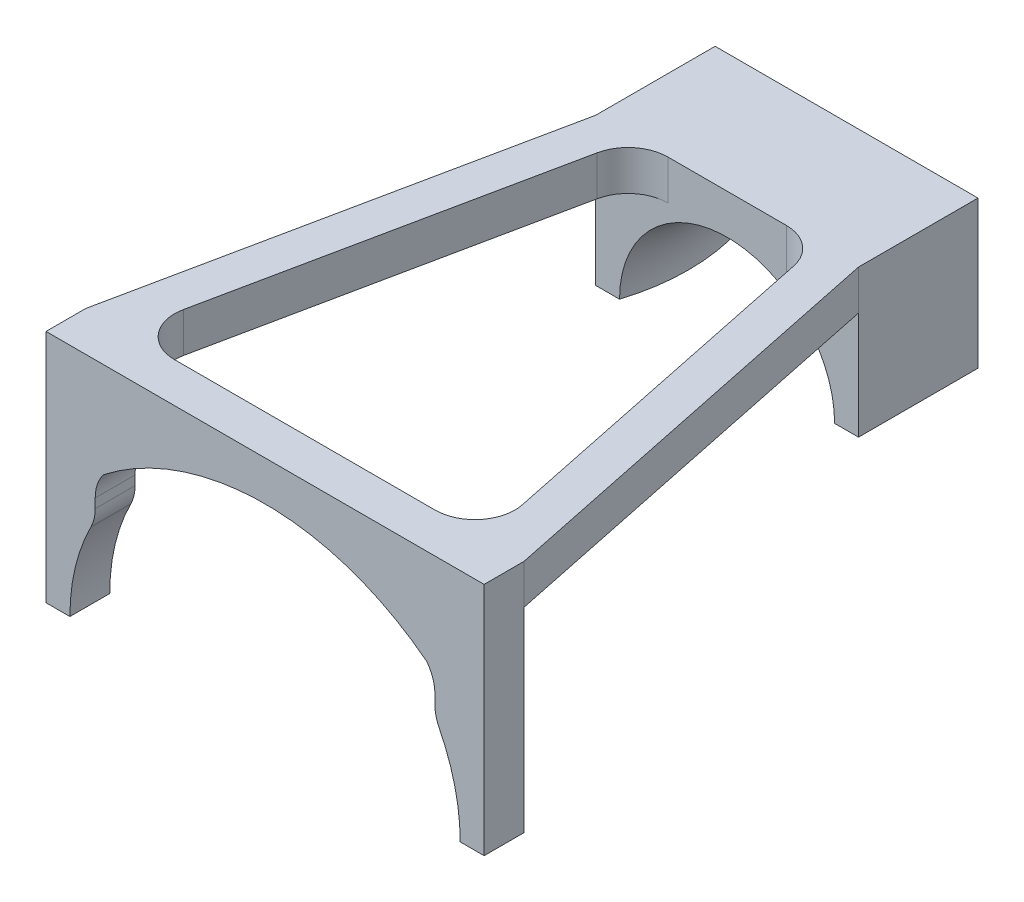
ISO-10303-21;
HEADER;
FILE_DESCRIPTION(('STEP AP214'),'2;1');
FILE_NAME('part.step','',(''),(''),'','','');
FILE_SCHEMA(('AUTOMOTIVE_DESIGN { 1 0 10303 214 1 1 1 1 }'));
ENDSEC;
DATA;
#1=APPLICATION_CONTEXT('core data for automotive mechanical design processes');
#2=APPLICATION_PROTOCOL_DEFINITION('international standard','automotive_design',2000,#1);
#3=PRODUCT_CONTEXT('',#1,'mechanical');
#4=PRODUCT('Part','Part','',(#3));
#5=PRODUCT_RELATED_PRODUCT_CATEGORY('part','',(#4));
#6=PRODUCT_DEFINITION_FORMATION('','',#4);
#7=PRODUCT_DEFINITION_CONTEXT('part definition',#1,'design');
#8=PRODUCT_DEFINITION('design','',#6,#7);
#9=PRODUCT_DEFINITION_SHAPE('','',#8);
#10=(LENGTH_UNIT() NAMED_UNIT(*) SI_UNIT(.MILLI.,.METRE.));
#11=(NAMED_UNIT(*) PLANE_ANGLE_UNIT() SI_UNIT($,.RADIAN.));
#12=(NAMED_UNIT(*) SI_UNIT($,.STERADIAN.) SOLID_ANGLE_UNIT());
#13=UNCERTAINTY_MEASURE_WITH_UNIT(LENGTH_MEASURE(1.E-05),#10,'distance_accuracy_value','');
#14=(GEOMETRIC_REPRESENTATION_CONTEXT(3) GLOBAL_UNCERTAINTY_ASSIGNED_CONTEXT((#13)) GLOBAL_UNIT_ASSIGNED_CONTEXT((#10,
#11,#12)) REPRESENTATION_CONTEXT('',''));
#15=CARTESIAN_POINT('',(0.,0.,0.));
#16=DIRECTION('',(0.,0.,1.));
#17=DIRECTION('',(1.,0.,0.));
#18=AXIS2_PLACEMENT_3D('',#15,#16,#17);
#19=CARTESIAN_POINT('',(0.,0.,0.));
#20=DIRECTION('',(0.,0.,-1.));
#21=DIRECTION('',(-1.,0.,0.));
#22=AXIS2_PLACEMENT_3D('',#19,#20,#21);
#23=PLANE('',#22);
#24=DIRECTION('',(1.,0.,0.));
#25=VECTOR('',#24,1.);
#26=CARTESIAN_POINT('',(-27.5,24.5,0.));
#27=LINE('',#26,#25);
#28=CARTESIAN_POINT('',(-27.5,24.5,0.));
#29=VERTEX_POINT('',#28);
#30=CARTESIAN_POINT('',(-16.3557099612361,24.5,0.));
#31=VERTEX_POINT('',#30);
#32=EDGE_CURVE('E55',#29,#31,#27,.T.);
#33=ORIENTED_EDGE('',*,*,#32,.T.);
#34=DIRECTION('',(0.,1.,0.));
#35=VECTOR('',#34,1.);
#36=CARTESIAN_POINT('',(-16.3557099612361,29.5,0.));
#37=LINE('',#36,#35);
#38=CARTESIAN_POINT('',(-16.3557099612361,29.5,0.));
#39=VERTEX_POINT('',#38);
#40=EDGE_CURVE('E364',#31,#39,#37,.T.);
#41=ORIENTED_EDGE('',*,*,#40,.T.);
#42=DIRECTION('',(-1.,0.,0.));
#43=VECTOR('',#42,1.);
#44=CARTESIAN_POINT('',(-27.5,29.5,0.));
#45=LINE('',#44,#43);
#46=CARTESIAN_POINT('',(16.3557099612361,29.5,0.));
#47=VERTEX_POINT('',#46);
#48=EDGE_CURVE('E391',#47,#39,#45,.T.);
#49=ORIENTED_EDGE('',*,*,#48,.F.);
#50=DIRECTION('',(0.,1.,0.));
#51=VECTOR('',#50,1.);
#52=CARTESIAN_POINT('',(16.3557099612361,24.5,0.));
#53=LINE('',#52,#51);
#54=CARTESIAN_POINT('',(16.3557099612361,24.5,0.));
#55=VERTEX_POINT('',#54);
#56=EDGE_CURVE('E263',#47,#55,#53,.F.);
#57=ORIENTED_EDGE('',*,*,#56,.T.);
#58=DIRECTION('',(1.,0.,0.));
#59=VECTOR('',#58,1.);
#60=CARTESIAN_POINT('',(27.5,24.5,0.));
#61=LINE('',#60,#59);
#62=CARTESIAN_POINT('',(27.5,24.5,0.));
#63=VERTEX_POINT('',#62);
#64=EDGE_CURVE('E62',#55,#63,#61,.T.);
#65=ORIENTED_EDGE('',*,*,#64,.T.);
#66=DIRECTION('',(0.,1.,0.));
#67=VECTOR('',#66,1.);
#68=CARTESIAN_POINT('',(27.5,0.,0.));
#69=LINE('',#68,#67);
#70=CARTESIAN_POINT('',(27.5,0.,0.));
#71=VERTEX_POINT('',#70);
#72=EDGE_CURVE('E260',#71,#63,#69,.T.);
#73=ORIENTED_EDGE('',*,*,#72,.F.);
#74=DIRECTION('',(1.,0.,0.));
#75=VECTOR('',#74,1.);
#76=CARTESIAN_POINT('',(24.5,0.,0.));
#77=LINE('',#76,#75);
#78=CARTESIAN_POINT('',(24.5,0.,0.));
#79=VERTEX_POINT('',#78);
#80=EDGE_CURVE('E275',#79,#71,#77,.T.);
#81=ORIENTED_EDGE('',*,*,#80,.F.);
#82=CARTESIAN_POINT('',(0.,0.,0.));
#83=DIRECTION('',(0.,0.,-1.));
#84=DIRECTION('',(-1.,0.,0.));
#85=AXIS2_PLACEMENT_3D('',#82,#83,#84);
#86=CIRCLE('',#85,24.5);
#87=CARTESIAN_POINT('',(21.8615384615385,11.0599790277683,0.));
#88=VERTEX_POINT('',#87);
#89=EDGE_CURVE('E282',#88,#79,#86,.T.);
#90=ORIENTED_EDGE('',*,*,#89,.F.);
#91=CARTESIAN_POINT('',(26.3230769230769,13.3171176048639,0.));
#92=DIRECTION('',(0.,0.,1.));
#93=DIRECTION('',(1.,0.,0.));
#94=AXIS2_PLACEMENT_3D('',#91,#92,#93);
#95=CIRCLE('',#94,5.);
#96=CARTESIAN_POINT('',(21.3230769230769,13.3171176048639,0.));
#97=VERTEX_POINT('',#96);
#98=EDGE_CURVE('E575',#97,#88,#95,.T.);
#99=ORIENTED_EDGE('',*,*,#98,.F.);
#100=DIRECTION('',(0.,-1.,0.));
#101=VECTOR('',#100,1.);
#102=CARTESIAN_POINT('',(21.3230769230769,14.4852505589068,0.));
#103=LINE('',#102,#101);
#104=CARTESIAN_POINT('',(21.3230769230769,14.4852505589068,0.));
#105=VERTEX_POINT('',#104);
#106=EDGE_CURVE('E572',#105,#97,#103,.T.);
#107=ORIENTED_EDGE('',*,*,#106,.F.);
#108=CARTESIAN_POINT('',(16.3230769230769,14.4852505589068,0.));
#109=DIRECTION('',(0.,0.,-1.));
#110=DIRECTION('',(-1.,0.,0.));
#111=AXIS2_PLACEMENT_3D('',#108,#109,#110);
#112=CIRCLE('',#111,5.);
#113=CARTESIAN_POINT('',(20.2967620018153,17.5200202198551,0.));
#114=VERTEX_POINT('',#113);
#115=EDGE_CURVE('E569',#114,#105,#112,.T.);
#116=ORIENTED_EDGE('',*,*,#115,.F.);
#117=CARTESIAN_POINT('',(0.,-8.5,0.));
#118=DIRECTION('',(0.,0.,-1.));
#119=DIRECTION('',(-1.,0.,0.));
#120=AXIS2_PLACEMENT_3D('',#117,#118,#119);
#121=CIRCLE('',#120,33.);
#122=CARTESIAN_POINT('',(-20.2967620018153,17.5200202198551,0.));
#123=VERTEX_POINT('',#122);
#124=EDGE_CURVE('E566',#123,#114,#121,.T.);
#125=ORIENTED_EDGE('',*,*,#124,.F.);
#126=CARTESIAN_POINT('',(-16.3230769230769,14.4852505589068,0.));
#127=DIRECTION('',(0.,0.,-1.));
#128=DIRECTION('',(1.,0.,0.));
#129=AXIS2_PLACEMENT_3D('',#126,#127,#128);
#130=CIRCLE('',#129,5.);
#131=CARTESIAN_POINT('',(-21.3230769230769,14.4852505589068,0.));
#132=VERTEX_POINT('',#131);
#133=EDGE_CURVE('E562',#132,#123,#130,.T.);
#134=ORIENTED_EDGE('',*,*,#133,.F.);
#135=DIRECTION('',(0.,1.,0.));
#136=VECTOR('',#135,1.);
#137=CARTESIAN_POINT('',(-21.3230769230769,14.4852505589068,0.));
#138=LINE('',#137,#136);
#139=CARTESIAN_POINT('',(-21.3230769230769,13.3171176048639,0.));
#140=VERTEX_POINT('',#139);
#141=EDGE_CURVE('E559',#140,#132,#138,.T.);
#142=ORIENTED_EDGE('',*,*,#141,.F.);
#143=CARTESIAN_POINT('',(-26.3230769230769,13.3171176048639,0.));
#144=DIRECTION('',(0.,0.,1.));
#145=DIRECTION('',(-1.,0.,0.));
#146=AXIS2_PLACEMENT_3D('',#143,#144,#145);
#147=CIRCLE('',#146,5.);
#148=CARTESIAN_POINT('',(-21.8615384615385,11.0599790277683,0.));
#149=VERTEX_POINT('',#148);
#150=EDGE_CURVE('E556',#149,#140,#147,.T.);
#151=ORIENTED_EDGE('',*,*,#150,.F.);
#152=CARTESIAN_POINT('',(0.,0.,0.));
#153=DIRECTION('',(0.,0.,-1.));
#154=DIRECTION('',(1.,0.,0.));
#155=AXIS2_PLACEMENT_3D('',#152,#153,#154);
#156=CIRCLE('',#155,24.5);
#157=CARTESIAN_POINT('',(-24.5,0.,0.));
#158=VERTEX_POINT('',#157);
#159=EDGE_CURVE('E553',#158,#149,#156,.T.);
#160=ORIENTED_EDGE('',*,*,#159,.F.);
#161=DIRECTION('',(1.,0.,0.));
#162=VECTOR('',#161,1.);
#163=CARTESIAN_POINT('',(-24.5,0.,0.));
#164=LINE('',#163,#162);
#165=CARTESIAN_POINT('',(-27.5,0.,0.));
#166=VERTEX_POINT('',#165);
#167=EDGE_CURVE('E550',#166,#158,#164,.T.);
#168=ORIENTED_EDGE('',*,*,#167,.F.);
#169=DIRECTION('',(0.,-1.,0.));
#170=VECTOR('',#169,1.);
#171=CARTESIAN_POINT('',(-27.5,0.,0.));
#172=LINE('',#171,#170);
#173=EDGE_CURVE('E397',#29,#166,#172,.T.);
#174=ORIENTED_EDGE('',*,*,#173,.F.);
#175=EDGE_LOOP('',(#33,#41,#49,#57,#65,#73,#81,#90,#99,#107,#116,#125,#134,#142,#151,#160,#168,#174));
#176=FACE_BOUND('',#175,.T.);
#177=ADVANCED_FACE('F39',(#176),#23,.T.);
#178=CARTESIAN_POINT('',(-27.5,29.5,5.));
#179=DIRECTION('',(0.,-1.,0.));
#180=DIRECTION('',(0.,0.,-1.));
#181=AXIS2_PLACEMENT_3D('',#178,#179,#180);
#182=PLANE('',#181);
#183=DIRECTION('',(-1.,0.,0.));
#184=VECTOR('',#183,1.);
#185=CARTESIAN_POINT('',(-16.5,29.5,-53.));
#186=LINE('',#185,#184);
#187=CARTESIAN_POINT('',(7.4311816593493,29.5,-53.));
#188=VERTEX_POINT('',#187);
#189=CARTESIAN_POINT('',(-7.4311816593493,29.5,-53.));
#190=VERTEX_POINT('',#189);
#191=EDGE_CURVE('E461',#188,#190,#186,.T.);
#192=ORIENTED_EDGE('',*,*,#191,.F.);
#193=CARTESIAN_POINT('',(7.4311816593493,29.5,-48.));
#194=DIRECTION('',(0.,-1.,0.));
#195=DIRECTION('',(0.,0.,-1.));
#196=AXIS2_PLACEMENT_3D('',#193,#194,#195);
#197=CIRCLE('',#196,5.);
#198=CARTESIAN_POINT('',(12.326850846683,29.5,-49.0160822841636));
#199=VERTEX_POINT('',#198);
#200=EDGE_CURVE('E373',#188,#199,#197,.T.);
#201=ORIENTED_EDGE('',*,*,#200,.T.);
#202=DIRECTION('',(0.203216456832721,0.,0.979133837466745));
#203=VECTOR('',#202,1.);
#204=CARTESIAN_POINT('',(22.5,29.5,0.));
#205=LINE('',#204,#203);
#206=CARTESIAN_POINT('',(21.2513791485698,29.5,-6.0160822841636));
#207=VERTEX_POINT('',#206);
#208=EDGE_CURVE('E266',#199,#207,#205,.T.);
#209=ORIENTED_EDGE('',*,*,#208,.T.);
#210=CARTESIAN_POINT('',(16.3557099612361,29.5,-5.));
#211=DIRECTION('',(0.,-1.,0.));
#212=DIRECTION('',(0.,0.,-1.));
#213=AXIS2_PLACEMENT_3D('',#210,#211,#212);
#214=CIRCLE('',#213,5.);
#215=EDGE_CURVE('E48',#207,#47,#214,.T.);
#216=ORIENTED_EDGE('',*,*,#215,.T.);
#217=ORIENTED_EDGE('',*,*,#48,.T.);
#218=CARTESIAN_POINT('',(-16.3557099612361,29.5,-5.));
#219=DIRECTION('',(0.,-1.,0.));
#220=DIRECTION('',(0.,0.,-1.));
#221=AXIS2_PLACEMENT_3D('',#218,#219,#220);
#222=CIRCLE('',#221,5.);
#223=CARTESIAN_POINT('',(-21.2513791485698,29.5,-6.0160822841636));
#224=VERTEX_POINT('',#223);
#225=EDGE_CURVE('E379',#39,#224,#222,.T.);
#226=ORIENTED_EDGE('',*,*,#225,.T.);
#227=DIRECTION('',(0.203216456832721,0.,-0.979133837466745));
#228=VECTOR('',#227,1.);
#229=CARTESIAN_POINT('',(-22.5,29.5,0.));
#230=LINE('',#229,#228);
#231=CARTESIAN_POINT('',(-12.326850846683,29.5,-49.0160822841636));
#232=VERTEX_POINT('',#231);
#233=EDGE_CURVE('E475',#224,#232,#230,.T.);
#234=ORIENTED_EDGE('',*,*,#233,.T.);
#235=CARTESIAN_POINT('',(-7.4311816593493,29.5,-48.));
#236=DIRECTION('',(0.,-1.,0.));
#237=DIRECTION('',(0.,0.,-1.));
#238=AXIS2_PLACEMENT_3D('',#235,#236,#237);
#239=CIRCLE('',#238,5.);
#240=EDGE_CURVE('E367',#232,#190,#239,.T.);
#241=ORIENTED_EDGE('',*,*,#240,.T.);
#242=EDGE_LOOP('',(#192,#201,#209,#216,#217,#226,#234,#241));
#243=FACE_BOUND('',#242,.T.);
#244=DIRECTION('',(0.,0.,-1.));
#245=VECTOR('',#244,1.);
#246=CARTESIAN_POINT('',(27.5,29.5,5.));
#247=LINE('',#246,#245);
#248=CARTESIAN_POINT('',(27.5,29.5,5.));
#249=VERTEX_POINT('',#248);
#250=CARTESIAN_POINT('',(27.5,29.5,0.));
#251=VERTEX_POINT('',#250);
#252=EDGE_CURVE('E286',#249,#251,#247,.T.);
#253=ORIENTED_EDGE('',*,*,#252,.T.);
#254=DIRECTION('',(-0.203216456832721,0.,-0.979133837466745));
#255=VECTOR('',#254,1.);
#256=CARTESIAN_POINT('',(27.5,29.5,0.));
#257=LINE('',#256,#255);
#258=CARTESIAN_POINT('',(16.5,29.5,-53.));
#259=VERTEX_POINT('',#258);
#260=EDGE_CURVE('E243',#251,#259,#257,.T.);
#261=ORIENTED_EDGE('',*,*,#260,.T.);
#262=DIRECTION('',(0.,0.,1.));
#263=VECTOR('',#262,1.);
#264=CARTESIAN_POINT('',(16.5,29.5,-68.));
#265=LINE('',#264,#263);
#266=CARTESIAN_POINT('',(16.5,29.5,-68.));
#267=VERTEX_POINT('',#266);
#268=EDGE_CURVE('E480',#267,#259,#265,.T.);
#269=ORIENTED_EDGE('',*,*,#268,.F.);
#270=DIRECTION('',(-1.,0.,0.));
#271=VECTOR('',#270,1.);
#272=CARTESIAN_POINT('',(-16.5,29.5,-68.));
#273=LINE('',#272,#271);
#274=CARTESIAN_POINT('',(-16.5,29.5,-68.));
#275=VERTEX_POINT('',#274);
#276=EDGE_CURVE('E437',#267,#275,#273,.T.);
#277=ORIENTED_EDGE('',*,*,#276,.T.);
#278=DIRECTION('',(0.,0.,1.));
#279=VECTOR('',#278,1.);
#280=CARTESIAN_POINT('',(-16.5,29.5,-68.));
#281=LINE('',#280,#279);
#282=CARTESIAN_POINT('',(-16.5,29.5,-53.));
#283=VERTEX_POINT('',#282);
#284=EDGE_CURVE('E476',#275,#283,#281,.T.);
#285=ORIENTED_EDGE('',*,*,#284,.T.);
#286=DIRECTION('',(-0.203216456832721,0.,0.979133837466745));
#287=VECTOR('',#286,1.);
#288=CARTESIAN_POINT('',(-27.5,29.5,0.));
#289=LINE('',#288,#287);
#290=CARTESIAN_POINT('',(-27.5,29.5,0.));
#291=VERTEX_POINT('',#290);
#292=EDGE_CURVE('E488',#283,#291,#289,.T.);
#293=ORIENTED_EDGE('',*,*,#292,.T.);
#294=DIRECTION('',(0.,0.,-1.));
#295=VECTOR('',#294,1.);
#296=CARTESIAN_POINT('',(-27.5,29.5,5.));
#297=LINE('',#296,#295);
#298=CARTESIAN_POINT('',(-27.5,29.5,5.));
#299=VERTEX_POINT('',#298);
#300=EDGE_CURVE('E336',#299,#291,#297,.T.);
#301=ORIENTED_EDGE('',*,*,#300,.F.);
#302=DIRECTION('',(-1.,0.,0.));
#303=VECTOR('',#302,1.);
#304=CARTESIAN_POINT('',(-27.5,29.5,5.));
#305=LINE('',#304,#303);
#306=EDGE_CURVE('E274',#249,#299,#305,.T.);
#307=ORIENTED_EDGE('',*,*,#306,.F.);
#308=EDGE_LOOP('',(#253,#261,#269,#277,#285,#293,#301,#307));
#309=FACE_BOUND('',#308,.T.);
#310=ADVANCED_FACE('F389',(#243,#309),#182,.F.);
#311=CARTESIAN_POINT('',(-27.5,0.,5.));
#312=DIRECTION('',(1.,0.,0.));
#313=DIRECTION('',(0.,0.,-1.));
#314=AXIS2_PLACEMENT_3D('',#311,#312,#313);
#315=PLANE('',#314);
#316=EDGE_CURVE('E546',#291,#29,#172,.T.);
#317=ORIENTED_EDGE('',*,*,#316,.T.);
#318=ORIENTED_EDGE('',*,*,#173,.T.);
#319=DIRECTION('',(0.,0.,-1.));
#320=VECTOR('',#319,1.);
#321=CARTESIAN_POINT('',(-27.5,0.,5.));
#322=LINE('',#321,#320);
#323=CARTESIAN_POINT('',(-27.5,0.,5.));
#324=VERTEX_POINT('',#323);
#325=EDGE_CURVE('E332',#324,#166,#322,.T.);
#326=ORIENTED_EDGE('',*,*,#325,.F.);
#327=DIRECTION('',(0.,-1.,0.));
#328=VECTOR('',#327,1.);
#329=CARTESIAN_POINT('',(-27.5,0.,5.));
#330=LINE('',#329,#328);
#331=EDGE_CURVE('E280',#299,#324,#330,.T.);
#332=ORIENTED_EDGE('',*,*,#331,.F.);
#333=ORIENTED_EDGE('',*,*,#300,.T.);
#334=EDGE_LOOP('',(#317,#318,#326,#332,#333));
#335=FACE_BOUND('',#334,.T.);
#336=ADVANCED_FACE('F635',(#335),#315,.F.);
#337=CARTESIAN_POINT('',(-24.5,0.,5.));
#338=DIRECTION('',(0.,1.,0.));
#339=DIRECTION('',(-1.,0.,0.));
#340=AXIS2_PLACEMENT_3D('',#337,#338,#339);
#341=PLANE('',#340);
#342=ORIENTED_EDGE('',*,*,#167,.T.);
#343=DIRECTION('',(0.,0.,-1.));
#344=VECTOR('',#343,1.);
#345=CARTESIAN_POINT('',(-24.5,0.,5.));
#346=LINE('',#345,#344);
#347=CARTESIAN_POINT('',(-24.5,0.,5.));
#348=VERTEX_POINT('',#347);
#349=EDGE_CURVE('E328',#348,#158,#346,.T.);
#350=ORIENTED_EDGE('',*,*,#349,.F.);
#351=DIRECTION('',(1.,0.,0.));
#352=VECTOR('',#351,1.);
#353=CARTESIAN_POINT('',(-24.5,0.,5.));
#354=LINE('',#353,#352);
#355=EDGE_CURVE('E511',#324,#348,#354,.T.);
#356=ORIENTED_EDGE('',*,*,#355,.F.);
#357=ORIENTED_EDGE('',*,*,#325,.T.);
#358=EDGE_LOOP('',(#342,#350,#356,#357));
#359=FACE_BOUND('',#358,.T.);
#360=ADVANCED_FACE('F631',(#359),#341,.F.);
#361=CARTESIAN_POINT('',(0.,0.,5.));
#362=DIRECTION('',(0.,0.,-1.));
#363=DIRECTION('',(-1.,0.,0.));
#364=AXIS2_PLACEMENT_3D('',#361,#362,#363);
#365=CYLINDRICAL_SURFACE('',#364,24.5);
#366=ORIENTED_EDGE('',*,*,#159,.T.);
#367=DIRECTION('',(0.,0.,-1.));
#368=VECTOR('',#367,1.);
#369=CARTESIAN_POINT('',(-21.8615384615385,11.0599790277683,5.));
#370=LINE('',#369,#368);
#371=CARTESIAN_POINT('',(-21.8615384615385,11.0599790277683,5.));
#372=VERTEX_POINT('',#371);
#373=EDGE_CURVE('E324',#372,#149,#370,.T.);
#374=ORIENTED_EDGE('',*,*,#373,.F.);
#375=CARTESIAN_POINT('',(0.,0.,5.));
#376=DIRECTION('',(0.,0.,-1.));
#377=DIRECTION('',(1.,0.,0.));
#378=AXIS2_PLACEMENT_3D('',#375,#376,#377);
#379=CIRCLE('',#378,24.5);
#380=EDGE_CURVE('E514',#348,#372,#379,.T.);
#381=ORIENTED_EDGE('',*,*,#380,.F.);
#382=ORIENTED_EDGE('',*,*,#349,.T.);
#383=EDGE_LOOP('',(#366,#374,#381,#382));
#384=FACE_BOUND('',#383,.T.);
#385=ADVANCED_FACE('F627',(#384),#365,.F.);
#386=CARTESIAN_POINT('',(-26.3230769230769,13.3171176048639,5.));
#387=DIRECTION('',(0.,0.,-1.));
#388=DIRECTION('',(-1.,0.,0.));
#389=AXIS2_PLACEMENT_3D('',#386,#387,#388);
#390=CYLINDRICAL_SURFACE('',#389,5.);
#391=ORIENTED_EDGE('',*,*,#150,.T.);
#392=DIRECTION('',(0.,0.,-1.));
#393=VECTOR('',#392,1.);
#394=CARTESIAN_POINT('',(-21.3230769230769,13.3171176048639,5.));
#395=LINE('',#394,#393);
#396=CARTESIAN_POINT('',(-21.3230769230769,13.3171176048639,5.));
#397=VERTEX_POINT('',#396);
#398=EDGE_CURVE('E320',#397,#140,#395,.T.);
#399=ORIENTED_EDGE('',*,*,#398,.F.);
#400=CARTESIAN_POINT('',(-26.3230769230769,13.3171176048639,5.));
#401=DIRECTION('',(0.,0.,1.));
#402=DIRECTION('',(-1.,0.,0.));
#403=AXIS2_PLACEMENT_3D('',#400,#401,#402);
#404=CIRCLE('',#403,5.);
#405=EDGE_CURVE('E517',#372,#397,#404,.T.);
#406=ORIENTED_EDGE('',*,*,#405,.F.);
#407=ORIENTED_EDGE('',*,*,#373,.T.);
#408=EDGE_LOOP('',(#391,#399,#406,#407));
#409=FACE_BOUND('',#408,.T.);
#410=ADVANCED_FACE('F622',(#409),#390,.T.);
#411=CARTESIAN_POINT('',(-21.3230769230769,14.4852505589068,5.));
#412=DIRECTION('',(-1.,0.,0.));
#413=DIRECTION('',(0.,-1.,0.));
#414=AXIS2_PLACEMENT_3D('',#411,#412,#413);
#415=PLANE('',#414);
#416=ORIENTED_EDGE('',*,*,#141,.T.);
#417=DIRECTION('',(0.,0.,-1.));
#418=VECTOR('',#417,1.);
#419=CARTESIAN_POINT('',(-21.3230769230769,14.4852505589068,5.));
#420=LINE('',#419,#418);
#421=CARTESIAN_POINT('',(-21.3230769230769,14.4852505589068,5.));
#422=VERTEX_POINT('',#421);
#423=EDGE_CURVE('E316',#422,#132,#420,.T.);
#424=ORIENTED_EDGE('',*,*,#423,.F.);
#425=DIRECTION('',(0.,1.,0.));
#426=VECTOR('',#425,1.);
#427=CARTESIAN_POINT('',(-21.3230769230769,14.4852505589068,5.));
#428=LINE('',#427,#426);
#429=EDGE_CURVE('E520',#397,#422,#428,.T.);
#430=ORIENTED_EDGE('',*,*,#429,.F.);
#431=ORIENTED_EDGE('',*,*,#398,.T.);
#432=EDGE_LOOP('',(#416,#424,#430,#431));
#433=FACE_BOUND('',#432,.T.);
#434=ADVANCED_FACE('F616',(#433),#415,.F.);
#435=CARTESIAN_POINT('',(-16.3230769230769,14.4852505589068,5.));
#436=DIRECTION('',(0.,0.,-1.));
#437=DIRECTION('',(-1.,0.,0.));
#438=AXIS2_PLACEMENT_3D('',#435,#436,#437);
#439=CYLINDRICAL_SURFACE('',#438,5.);
#440=ORIENTED_EDGE('',*,*,#133,.T.);
#441=DIRECTION('',(0.,0.,-1.));
#442=VECTOR('',#441,1.);
#443=CARTESIAN_POINT('',(-20.2967620018153,17.5200202198551,5.));
#444=LINE('',#443,#442);
#445=CARTESIAN_POINT('',(-20.2967620018153,17.5200202198551,5.));
#446=VERTEX_POINT('',#445);
#447=EDGE_CURVE('E312',#446,#123,#444,.T.);
#448=ORIENTED_EDGE('',*,*,#447,.F.);
#449=CARTESIAN_POINT('',(-16.3230769230769,14.4852505589068,5.));
#450=DIRECTION('',(0.,0.,-1.));
#451=DIRECTION('',(1.,0.,0.));
#452=AXIS2_PLACEMENT_3D('',#449,#450,#451);
#453=CIRCLE('',#452,5.);
#454=EDGE_CURVE('E523',#422,#446,#453,.T.);
#455=ORIENTED_EDGE('',*,*,#454,.F.);
#456=ORIENTED_EDGE('',*,*,#423,.T.);
#457=EDGE_LOOP('',(#440,#448,#455,#456));
#458=FACE_BOUND('',#457,.T.);
#459=ADVANCED_FACE('F611',(#458),#439,.F.);
#460=CARTESIAN_POINT('',(0.,-8.5,5.));
#461=DIRECTION('',(0.,0.,-1.));
#462=DIRECTION('',(-1.,0.,0.));
#463=AXIS2_PLACEMENT_3D('',#460,#461,#462);
#464=CYLINDRICAL_SURFACE('',#463,33.);
#465=ORIENTED_EDGE('',*,*,#124,.T.);
#466=DIRECTION('',(0.,0.,-1.));
#467=VECTOR('',#466,1.);
#468=CARTESIAN_POINT('',(20.2967620018153,17.5200202198551,5.));
#469=LINE('',#468,#467);
#470=CARTESIAN_POINT('',(20.2967620018153,17.5200202198551,5.));
#471=VERTEX_POINT('',#470);
#472=EDGE_CURVE('E308',#471,#114,#469,.T.);
#473=ORIENTED_EDGE('',*,*,#472,.F.);
#474=CARTESIAN_POINT('',(0.,-8.5,5.));
#475=DIRECTION('',(0.,0.,-1.));
#476=DIRECTION('',(1.,0.,0.));
#477=AXIS2_PLACEMENT_3D('',#474,#475,#476);
#478=CIRCLE('',#477,33.);
#479=EDGE_CURVE('E526',#446,#471,#478,.T.);
#480=ORIENTED_EDGE('',*,*,#479,.F.);
#481=ORIENTED_EDGE('',*,*,#447,.T.);
#482=EDGE_LOOP('',(#465,#473,#480,#481));
#483=FACE_BOUND('',#482,.T.);
#484=ADVANCED_FACE('F606',(#483),#464,.F.);
#485=CARTESIAN_POINT('',(16.3230769230769,14.4852505589068,5.));
#486=DIRECTION('',(0.,0.,-1.));
#487=DIRECTION('',(-1.,0.,0.));
#488=AXIS2_PLACEMENT_3D('',#485,#486,#487);
#489=CYLINDRICAL_SURFACE('',#488,5.);
#490=ORIENTED_EDGE('',*,*,#115,.T.);
#491=DIRECTION('',(0.,0.,-1.));
#492=VECTOR('',#491,1.);
#493=CARTESIAN_POINT('',(21.3230769230769,14.4852505589068,5.));
#494=LINE('',#493,#492);
#495=CARTESIAN_POINT('',(21.3230769230769,14.4852505589068,5.));
#496=VERTEX_POINT('',#495);
#497=EDGE_CURVE('E304',#496,#105,#494,.T.);
#498=ORIENTED_EDGE('',*,*,#497,.F.);
#499=CARTESIAN_POINT('',(16.3230769230769,14.4852505589068,5.));
#500=DIRECTION('',(0.,0.,-1.));
#501=DIRECTION('',(-1.,0.,0.));
#502=AXIS2_PLACEMENT_3D('',#499,#500,#501);
#503=CIRCLE('',#502,5.);
#504=EDGE_CURVE('E529',#471,#496,#503,.T.);
#505=ORIENTED_EDGE('',*,*,#504,.F.);
#506=ORIENTED_EDGE('',*,*,#472,.T.);
#507=EDGE_LOOP('',(#490,#498,#505,#506));
#508=FACE_BOUND('',#507,.T.);
#509=ADVANCED_FACE('F602',(#508),#489,.F.);
#510=CARTESIAN_POINT('',(21.3230769230769,14.4852505589068,5.));
#511=DIRECTION('',(1.,0.,0.));
#512=DIRECTION('',(0.,1.,0.));
#513=AXIS2_PLACEMENT_3D('',#510,#511,#512);
#514=PLANE('',#513);
#515=ORIENTED_EDGE('',*,*,#106,.T.);
#516=DIRECTION('',(0.,0.,-1.));
#517=VECTOR('',#516,1.);
#518=CARTESIAN_POINT('',(21.3230769230769,13.3171176048639,5.));
#519=LINE('',#518,#517);
#520=CARTESIAN_POINT('',(21.3230769230769,13.3171176048639,5.));
#521=VERTEX_POINT('',#520);
#522=EDGE_CURVE('E300',#521,#97,#519,.T.);
#523=ORIENTED_EDGE('',*,*,#522,.F.);
#524=DIRECTION('',(0.,-1.,0.));
#525=VECTOR('',#524,1.);
#526=CARTESIAN_POINT('',(21.3230769230769,14.4852505589068,5.));
#527=LINE('',#526,#525);
#528=EDGE_CURVE('E532',#496,#521,#527,.T.);
#529=ORIENTED_EDGE('',*,*,#528,.F.);
#530=ORIENTED_EDGE('',*,*,#497,.T.);
#531=EDGE_LOOP('',(#515,#523,#529,#530));
#532=FACE_BOUND('',#531,.T.);
#533=ADVANCED_FACE('F598',(#532),#514,.F.);
#534=CARTESIAN_POINT('',(26.3230769230769,13.3171176048639,5.));
#535=DIRECTION('',(0.,0.,-1.));
#536=DIRECTION('',(-1.,0.,0.));
#537=AXIS2_PLACEMENT_3D('',#534,#535,#536);
#538=CYLINDRICAL_SURFACE('',#537,5.);
#539=ORIENTED_EDGE('',*,*,#98,.T.);
#540=DIRECTION('',(0.,0.,-1.));
#541=VECTOR('',#540,1.);
#542=CARTESIAN_POINT('',(21.8615384615385,11.0599790277683,5.));
#543=LINE('',#542,#541);
#544=CARTESIAN_POINT('',(21.8615384615385,11.0599790277683,5.));
#545=VERTEX_POINT('',#544);
#546=EDGE_CURVE('E296',#545,#88,#543,.T.);
#547=ORIENTED_EDGE('',*,*,#546,.F.);
#548=CARTESIAN_POINT('',(26.3230769230769,13.3171176048639,5.));
#549=DIRECTION('',(0.,0.,1.));
#550=DIRECTION('',(1.,0.,0.));
#551=AXIS2_PLACEMENT_3D('',#548,#549,#550);
#552=CIRCLE('',#551,5.);
#553=EDGE_CURVE('E535',#521,#545,#552,.T.);
#554=ORIENTED_EDGE('',*,*,#553,.F.);
#555=ORIENTED_EDGE('',*,*,#522,.T.);
#556=EDGE_LOOP('',(#539,#547,#554,#555));
#557=FACE_BOUND('',#556,.T.);
#558=ADVANCED_FACE('F594',(#557),#538,.T.);
#559=CARTESIAN_POINT('',(0.,0.,5.));
#560=DIRECTION('',(0.,0.,-1.));
#561=DIRECTION('',(-1.,0.,0.));
#562=AXIS2_PLACEMENT_3D('',#559,#560,#561);
#563=CYLINDRICAL_SURFACE('',#562,24.5);
#564=ORIENTED_EDGE('',*,*,#89,.T.);
#565=DIRECTION('',(0.,0.,-1.));
#566=VECTOR('',#565,1.);
#567=CARTESIAN_POINT('',(24.5,0.,5.));
#568=LINE('',#567,#566);
#569=CARTESIAN_POINT('',(24.5,0.,5.));
#570=VERTEX_POINT('',#569);
#571=EDGE_CURVE('E292',#570,#79,#568,.T.);
#572=ORIENTED_EDGE('',*,*,#571,.F.);
#573=CARTESIAN_POINT('',(0.,0.,5.));
#574=DIRECTION('',(0.,0.,-1.));
#575=DIRECTION('',(-1.,0.,0.));
#576=AXIS2_PLACEMENT_3D('',#573,#574,#575);
#577=CIRCLE('',#576,24.5);
#578=EDGE_CURVE('E538',#545,#570,#577,.T.);
#579=ORIENTED_EDGE('',*,*,#578,.F.);
#580=ORIENTED_EDGE('',*,*,#546,.T.);
#581=EDGE_LOOP('',(#564,#572,#579,#580));
#582=FACE_BOUND('',#581,.T.);
#583=ADVANCED_FACE('F581',(#582),#563,.F.);
#584=CARTESIAN_POINT('',(24.5,0.,5.));
#585=DIRECTION('',(0.,1.,0.));
#586=DIRECTION('',(-1.,0.,0.));
#587=AXIS2_PLACEMENT_3D('',#584,#585,#586);
#588=PLANE('',#587);
#589=ORIENTED_EDGE('',*,*,#80,.T.);
#590=DIRECTION('',(0.,0.,-1.));
#591=VECTOR('',#590,1.);
#592=CARTESIAN_POINT('',(27.5,0.,5.));
#593=LINE('',#592,#591);
#594=CARTESIAN_POINT('',(27.5,0.,5.));
#595=VERTEX_POINT('',#594);
#596=EDGE_CURVE('E272',#595,#71,#593,.T.);
#597=ORIENTED_EDGE('',*,*,#596,.F.);
#598=DIRECTION('',(1.,0.,0.));
#599=VECTOR('',#598,1.);
#600=CARTESIAN_POINT('',(24.5,0.,5.));
#601=LINE('',#600,#599);
#602=EDGE_CURVE('E541',#570,#595,#601,.T.);
#603=ORIENTED_EDGE('',*,*,#602,.F.);
#604=ORIENTED_EDGE('',*,*,#571,.T.);
#605=EDGE_LOOP('',(#589,#597,#603,#604));
#606=FACE_BOUND('',#605,.T.);
#607=ADVANCED_FACE('F587',(#606),#588,.F.);
#608=CARTESIAN_POINT('',(27.5,0.,5.));
#609=DIRECTION('',(-1.,0.,0.));
#610=DIRECTION('',(0.,0.,1.));
#611=AXIS2_PLACEMENT_3D('',#608,#609,#610);
#612=PLANE('',#611);
#613=ORIENTED_EDGE('',*,*,#72,.T.);
#614=DIRECTION('',(0.,1.,0.));
#615=VECTOR('',#614,1.);
#616=CARTESIAN_POINT('',(27.5,24.5,0.));
#617=LINE('',#616,#615);
#618=EDGE_CURVE('E238',#63,#251,#617,.T.);
#619=ORIENTED_EDGE('',*,*,#618,.T.);
#620=ORIENTED_EDGE('',*,*,#252,.F.);
#621=DIRECTION('',(0.,1.,0.));
#622=VECTOR('',#621,1.);
#623=CARTESIAN_POINT('',(27.5,0.,5.));
#624=LINE('',#623,#622);
#625=EDGE_CURVE('E289',#595,#249,#624,.T.);
#626=ORIENTED_EDGE('',*,*,#625,.F.);
#627=ORIENTED_EDGE('',*,*,#596,.T.);
#628=EDGE_LOOP('',(#613,#619,#620,#626,#627));
#629=FACE_BOUND('',#628,.T.);
#630=ADVANCED_FACE('F269',(#629),#612,.F.);
#631=CARTESIAN_POINT('',(0.,0.,5.));
#632=DIRECTION('',(0.,0.,-1.));
#633=DIRECTION('',(-1.,0.,0.));
#634=AXIS2_PLACEMENT_3D('',#631,#632,#633);
#635=PLANE('',#634);
#636=ORIENTED_EDGE('',*,*,#306,.T.);
#637=ORIENTED_EDGE('',*,*,#331,.T.);
#638=ORIENTED_EDGE('',*,*,#355,.T.);
#639=ORIENTED_EDGE('',*,*,#380,.T.);
#640=ORIENTED_EDGE('',*,*,#405,.T.);
#641=ORIENTED_EDGE('',*,*,#429,.T.);
#642=ORIENTED_EDGE('',*,*,#454,.T.);
#643=ORIENTED_EDGE('',*,*,#479,.T.);
#644=ORIENTED_EDGE('',*,*,#504,.T.);
#645=ORIENTED_EDGE('',*,*,#528,.T.);
#646=ORIENTED_EDGE('',*,*,#553,.T.);
#647=ORIENTED_EDGE('',*,*,#578,.T.);
#648=ORIENTED_EDGE('',*,*,#602,.T.);
#649=ORIENTED_EDGE('',*,*,#625,.T.);
#650=EDGE_LOOP('',(#636,#637,#638,#639,#640,#641,#642,#643,#644,#645,#646,#647,#648,#649));
#651=FACE_BOUND('',#650,.T.);
#652=ADVANCED_FACE('F589',(#651),#635,.F.);
#653=CARTESIAN_POINT('',(-27.5,24.5,0.));
#654=DIRECTION('',(-0.979133837466745,0.,-0.203216456832721));
#655=DIRECTION('',(-0.203216456832721,0.,0.979133837466745));
#656=AXIS2_PLACEMENT_3D('',#653,#654,#655);
#657=PLANE('',#656);
#658=ORIENTED_EDGE('',*,*,#292,.F.);
#659=DIRECTION('',(0.,1.,0.));
#660=VECTOR('',#659,1.);
#661=CARTESIAN_POINT('',(-16.5,24.5,-53.));
#662=LINE('',#661,#660);
#663=CARTESIAN_POINT('',(-16.5,24.5,-53.));
#664=VERTEX_POINT('',#663);
#665=EDGE_CURVE('E398',#664,#283,#662,.T.);
#666=ORIENTED_EDGE('',*,*,#665,.F.);
#667=DIRECTION('',(-0.203216456832721,0.,0.979133837466745));
#668=VECTOR('',#667,1.);
#669=CARTESIAN_POINT('',(-27.5,24.5,0.));
#670=LINE('',#669,#668);
#671=EDGE_CURVE('E496',#664,#29,#670,.T.);
#672=ORIENTED_EDGE('',*,*,#671,.T.);
#673=ORIENTED_EDGE('',*,*,#316,.F.);
#674=EDGE_LOOP('',(#658,#666,#672,#673));
#675=FACE_BOUND('',#674,.T.);
#676=ADVANCED_FACE('F638',(#675),#657,.T.);
#677=CARTESIAN_POINT('',(-22.5,24.5,0.));
#678=DIRECTION('',(0.979133837466745,0.,0.203216456832721));
#679=DIRECTION('',(0.203216456832721,0.,-0.979133837466745));
#680=AXIS2_PLACEMENT_3D('',#677,#678,#679);
#681=PLANE('',#680);
#682=DIRECTION('',(0.203216456832721,0.,-0.979133837466745));
#683=VECTOR('',#682,1.);
#684=CARTESIAN_POINT('',(-22.5,24.5,0.));
#685=LINE('',#684,#683);
#686=CARTESIAN_POINT('',(-21.2513791485698,24.5,-6.0160822841636));
#687=VERTEX_POINT('',#686);
#688=CARTESIAN_POINT('',(-12.326850846683,24.5,-49.0160822841636));
#689=VERTEX_POINT('',#688);
#690=EDGE_CURVE('E487',#687,#689,#685,.T.);
#691=ORIENTED_EDGE('',*,*,#690,.T.);
#692=DIRECTION('',(0.,1.,0.));
#693=VECTOR('',#692,1.);
#694=CARTESIAN_POINT('',(-12.326850846683,29.5,-49.0160822841636));
#695=LINE('',#694,#693);
#696=EDGE_CURVE('E343',#689,#232,#695,.T.);
#697=ORIENTED_EDGE('',*,*,#696,.T.);
#698=ORIENTED_EDGE('',*,*,#233,.F.);
#699=DIRECTION('',(0.,1.,0.));
#700=VECTOR('',#699,1.);
#701=CARTESIAN_POINT('',(-21.2513791485698,24.5,-6.0160822841636));
#702=LINE('',#701,#700);
#703=EDGE_CURVE('E340',#224,#687,#702,.F.);
#704=ORIENTED_EDGE('',*,*,#703,.T.);
#705=EDGE_LOOP('',(#691,#697,#698,#704));
#706=FACE_BOUND('',#705,.T.);
#707=ADVANCED_FACE('F659',(#706),#681,.T.);
#708=CARTESIAN_POINT('',(0.,24.5,0.));
#709=DIRECTION('',(0.,1.,0.));
#710=DIRECTION('',(0.,0.,1.));
#711=AXIS2_PLACEMENT_3D('',#708,#709,#710);
#712=PLANE('',#711);
#713=ORIENTED_EDGE('',*,*,#32,.F.);
#714=ORIENTED_EDGE('',*,*,#671,.F.);
#715=DIRECTION('',(-1.,0.,0.));
#716=VECTOR('',#715,1.);
#717=CARTESIAN_POINT('',(-11.5,24.5,-53.));
#718=LINE('',#717,#716);
#719=CARTESIAN_POINT('',(-7.4311816593493,24.5,-53.));
#720=VERTEX_POINT('',#719);
#721=EDGE_CURVE('E492',#720,#664,#718,.T.);
#722=ORIENTED_EDGE('',*,*,#721,.F.);
#723=CARTESIAN_POINT('',(-7.4311816593493,24.5,-48.));
#724=DIRECTION('',(0.,1.,0.));
#725=DIRECTION('',(0.,0.,1.));
#726=AXIS2_PLACEMENT_3D('',#723,#724,#725);
#727=CIRCLE('',#726,5.);
#728=EDGE_CURVE('E370',#720,#689,#727,.T.);
#729=ORIENTED_EDGE('',*,*,#728,.T.);
#730=ORIENTED_EDGE('',*,*,#690,.F.);
#731=CARTESIAN_POINT('',(-16.3557099612361,24.5,-5.));
#732=DIRECTION('',(0.,1.,0.));
#733=DIRECTION('',(0.,0.,1.));
#734=AXIS2_PLACEMENT_3D('',#731,#732,#733);
#735=CIRCLE('',#734,5.);
#736=EDGE_CURVE('E382',#687,#31,#735,.T.);
#737=ORIENTED_EDGE('',*,*,#736,.T.);
#738=EDGE_LOOP('',(#713,#714,#722,#729,#730,#737));
#739=FACE_BOUND('',#738,.T.);
#740=ADVANCED_FACE('F651',(#739),#712,.F.);
#741=CARTESIAN_POINT('',(0.,11.,-53.));
#742=DIRECTION('',(0.,0.,1.));
#743=DIRECTION('',(1.,0.,0.));
#744=AXIS2_PLACEMENT_3D('',#741,#742,#743);
#745=PLANE('',#744);
#746=ORIENTED_EDGE('',*,*,#191,.T.);
#747=DIRECTION('',(0.,1.,0.));
#748=VECTOR('',#747,1.);
#749=CARTESIAN_POINT('',(-7.4311816593493,24.5,-53.));
#750=LINE('',#749,#748);
#751=EDGE_CURVE('E351',#190,#720,#750,.F.);
#752=ORIENTED_EDGE('',*,*,#751,.T.);
#753=ORIENTED_EDGE('',*,*,#721,.T.);
#754=DIRECTION('',(0.,-1.,0.));
#755=VECTOR('',#754,1.);
#756=CARTESIAN_POINT('',(-16.5,11.,-53.));
#757=LINE('',#756,#755);
#758=CARTESIAN_POINT('',(-16.5,11.,-53.));
#759=VERTEX_POINT('',#758);
#760=EDGE_CURVE('E465',#664,#759,#757,.T.);
#761=ORIENTED_EDGE('',*,*,#760,.T.);
#762=DIRECTION('',(1.,0.,0.));
#763=VECTOR('',#762,1.);
#764=CARTESIAN_POINT('',(-16.5,11.,-53.));
#765=LINE('',#764,#763);
#766=CARTESIAN_POINT('',(-13.5,10.9999999999999,-53.));
#767=VERTEX_POINT('',#766);
#768=EDGE_CURVE('E429',#759,#767,#765,.T.);
#769=ORIENTED_EDGE('',*,*,#768,.T.);
#770=CARTESIAN_POINT('',(0.,11.,-53.));
#771=DIRECTION('',(0.,0.,-1.));
#772=DIRECTION('',(1.,0.,0.));
#773=AXIS2_PLACEMENT_3D('',#770,#771,#772);
#774=CIRCLE('',#773,13.5);
#775=CARTESIAN_POINT('',(13.5,11.,-53.));
#776=VERTEX_POINT('',#775);
#777=EDGE_CURVE('E424',#767,#776,#774,.T.);
#778=ORIENTED_EDGE('',*,*,#777,.T.);
#779=DIRECTION('',(1.,0.,0.));
#780=VECTOR('',#779,1.);
#781=CARTESIAN_POINT('',(16.5,11.,-53.));
#782=LINE('',#781,#780);
#783=CARTESIAN_POINT('',(16.5,11.,-53.));
#784=VERTEX_POINT('',#783);
#785=EDGE_CURVE('E453',#776,#784,#782,.T.);
#786=ORIENTED_EDGE('',*,*,#785,.T.);
#787=DIRECTION('',(0.,1.,0.));
#788=VECTOR('',#787,1.);
#789=CARTESIAN_POINT('',(16.5,11.,-53.));
#790=LINE('',#789,#788);
#791=CARTESIAN_POINT('',(16.5,24.5,-53.));
#792=VERTEX_POINT('',#791);
#793=EDGE_CURVE('E457',#784,#792,#790,.T.);
#794=ORIENTED_EDGE('',*,*,#793,.T.);
#795=DIRECTION('',(-1.,0.,0.));
#796=VECTOR('',#795,1.);
#797=CARTESIAN_POINT('',(11.5,24.5,-53.));
#798=LINE('',#797,#796);
#799=CARTESIAN_POINT('',(7.4311816593493,24.5,-53.));
#800=VERTEX_POINT('',#799);
#801=EDGE_CURVE('E255',#792,#800,#798,.T.);
#802=ORIENTED_EDGE('',*,*,#801,.T.);
#803=DIRECTION('',(0.,1.,0.));
#804=VECTOR('',#803,1.);
#805=CARTESIAN_POINT('',(7.4311816593493,29.5,-53.));
#806=LINE('',#805,#804);
#807=EDGE_CURVE('E347',#800,#188,#806,.T.);
#808=ORIENTED_EDGE('',*,*,#807,.T.);
#809=EDGE_LOOP('',(#746,#752,#753,#761,#769,#778,#786,#794,#802,#808));
#810=FACE_BOUND('',#809,.T.);
#811=ADVANCED_FACE('F647',(#810),#745,.T.);
#812=CARTESIAN_POINT('',(-16.5,11.,-68.));
#813=DIRECTION('',(0.,-1.,0.));
#814=DIRECTION('',(0.,0.,-1.));
#815=AXIS2_PLACEMENT_3D('',#812,#813,#814);
#816=PLANE('',#815);
#817=ORIENTED_EDGE('',*,*,#768,.F.);
#818=DIRECTION('',(0.,0.,1.));
#819=VECTOR('',#818,1.);
#820=CARTESIAN_POINT('',(-16.5,11.,-68.));
#821=LINE('',#820,#819);
#822=CARTESIAN_POINT('',(-16.5,11.,-68.));
#823=VERTEX_POINT('',#822);
#824=EDGE_CURVE('E471',#823,#759,#821,.T.);
#825=ORIENTED_EDGE('',*,*,#824,.F.);
#826=DIRECTION('',(1.,0.,0.));
#827=VECTOR('',#826,1.);
#828=CARTESIAN_POINT('',(-16.5,11.,-68.));
#829=LINE('',#828,#827);
#830=CARTESIAN_POINT('',(-13.5,10.9999999999999,-68.));
#831=VERTEX_POINT('',#830);
#832=EDGE_CURVE('E445',#823,#831,#829,.T.);
#833=ORIENTED_EDGE('',*,*,#832,.T.);
#834=CARTESIAN_POINT('',(-37.3484800354236,10.9999999999997,-60.5));
#835=DIRECTION('',(0.,1.,0.));
#836=DIRECTION('',(0.,0.,-1.));
#837=AXIS2_PLACEMENT_3D('',#834,#835,#836);
#838=CIRCLE('',#837,25.);
#839=EDGE_CURVE('E421',#767,#831,#838,.T.);
#840=ORIENTED_EDGE('',*,*,#839,.F.);
#841=EDGE_LOOP('',(#817,#825,#833,#840));
#842=FACE_BOUND('',#841,.T.);
#843=ADVANCED_FACE('F788',(#842),#816,.T.);
#844=CARTESIAN_POINT('',(-16.5,11.,-68.));
#845=DIRECTION('',(-1.,0.,0.));
#846=DIRECTION('',(0.,0.,1.));
#847=AXIS2_PLACEMENT_3D('',#844,#845,#846);
#848=PLANE('',#847);
#849=ORIENTED_EDGE('',*,*,#665,.T.);
#850=ORIENTED_EDGE('',*,*,#284,.F.);
#851=DIRECTION('',(0.,-1.,0.));
#852=VECTOR('',#851,1.);
#853=CARTESIAN_POINT('',(-16.5,11.,-68.));
#854=LINE('',#853,#852);
#855=EDGE_CURVE('E441',#275,#823,#854,.T.);
#856=ORIENTED_EDGE('',*,*,#855,.T.);
#857=ORIENTED_EDGE('',*,*,#824,.T.);
#858=ORIENTED_EDGE('',*,*,#760,.F.);
#859=EDGE_LOOP('',(#849,#850,#856,#857,#858));
#860=FACE_BOUND('',#859,.T.);
#861=ADVANCED_FACE('F645',(#860),#848,.T.);
#862=CARTESIAN_POINT('',(16.5,11.,-68.));
#863=DIRECTION('',(1.,0.,0.));
#864=DIRECTION('',(0.,0.,-1.));
#865=AXIS2_PLACEMENT_3D('',#862,#863,#864);
#866=PLANE('',#865);
#867=ORIENTED_EDGE('',*,*,#793,.F.);
#868=DIRECTION('',(0.,0.,1.));
#869=VECTOR('',#868,1.);
#870=CARTESIAN_POINT('',(16.5,11.,-68.));
#871=LINE('',#870,#869);
#872=CARTESIAN_POINT('',(16.5,11.,-68.));
#873=VERTEX_POINT('',#872);
#874=EDGE_CURVE('E449',#873,#784,#871,.T.);
#875=ORIENTED_EDGE('',*,*,#874,.F.);
#876=DIRECTION('',(0.,1.,0.));
#877=VECTOR('',#876,1.);
#878=CARTESIAN_POINT('',(16.5,11.,-68.));
#879=LINE('',#878,#877);
#880=EDGE_CURVE('E433',#873,#267,#879,.T.);
#881=ORIENTED_EDGE('',*,*,#880,.T.);
#882=ORIENTED_EDGE('',*,*,#268,.T.);
#883=DIRECTION('',(0.,1.,0.));
#884=VECTOR('',#883,1.);
#885=CARTESIAN_POINT('',(16.5,24.5,-53.));
#886=LINE('',#885,#884);
#887=EDGE_CURVE('E249',#792,#259,#886,.T.);
#888=ORIENTED_EDGE('',*,*,#887,.F.);
#889=EDGE_LOOP('',(#867,#875,#881,#882,#888));
#890=FACE_BOUND('',#889,.T.);
#891=ADVANCED_FACE('F802',(#890),#866,.T.);
#892=CARTESIAN_POINT('',(16.5,11.,-68.));
#893=DIRECTION('',(0.,-1.,0.));
#894=DIRECTION('',(0.,0.,-1.));
#895=AXIS2_PLACEMENT_3D('',#892,#893,#894);
#896=PLANE('',#895);
#897=ORIENTED_EDGE('',*,*,#785,.F.);
#898=CARTESIAN_POINT('',(37.3484800354236,11.,-60.5));
#899=DIRECTION('',(0.,-1.,0.));
#900=DIRECTION('',(0.,0.,-1.));
#901=AXIS2_PLACEMENT_3D('',#898,#899,#900);
#902=CIRCLE('',#901,25.);
#903=CARTESIAN_POINT('',(13.5,11.,-68.));
#904=VERTEX_POINT('',#903);
#905=EDGE_CURVE('E416',#776,#904,#902,.T.);
#906=ORIENTED_EDGE('',*,*,#905,.T.);
#907=DIRECTION('',(1.,0.,0.));
#908=VECTOR('',#907,1.);
#909=CARTESIAN_POINT('',(16.5,11.,-68.));
#910=LINE('',#909,#908);
#911=EDGE_CURVE('E428',#904,#873,#910,.T.);
#912=ORIENTED_EDGE('',*,*,#911,.T.);
#913=ORIENTED_EDGE('',*,*,#874,.T.);
#914=EDGE_LOOP('',(#897,#906,#912,#913));
#915=FACE_BOUND('',#914,.T.);
#916=ADVANCED_FACE('F809',(#915),#896,.T.);
#917=CARTESIAN_POINT('',(0.,11.,-68.));
#918=DIRECTION('',(0.,0.,1.));
#919=DIRECTION('',(1.,0.,0.));
#920=AXIS2_PLACEMENT_3D('',#917,#918,#919);
#921=PLANE('',#920);
#922=CARTESIAN_POINT('',(0.,11.,-68.));
#923=DIRECTION('',(0.,0.,-1.));
#924=DIRECTION('',(1.,0.,0.));
#925=AXIS2_PLACEMENT_3D('',#922,#923,#924);
#926=CIRCLE('',#925,13.5);
#927=EDGE_CURVE('E425',#831,#904,#926,.T.);
#928=ORIENTED_EDGE('',*,*,#927,.F.);
#929=ORIENTED_EDGE('',*,*,#832,.F.);
#930=ORIENTED_EDGE('',*,*,#855,.F.);
#931=ORIENTED_EDGE('',*,*,#276,.F.);
#932=ORIENTED_EDGE('',*,*,#880,.F.);
#933=ORIENTED_EDGE('',*,*,#911,.F.);
#934=EDGE_LOOP('',(#928,#929,#930,#931,#932,#933));
#935=FACE_BOUND('',#934,.T.);
#936=ADVANCED_FACE('F817',(#935),#921,.F.);
#937=CARTESIAN_POINT('',(0.,11.,-60.5));
#938=DIRECTION('',(0.,0.,-1.));
#939=DIRECTION('',(-1.,0.,0.));
#940=AXIS2_PLACEMENT_3D('',#937,#938,#939);
#941=TOROIDAL_SURFACE('',#940,37.3484800354236,25.);
#942=ORIENTED_EDGE('',*,*,#927,.T.);
#943=ORIENTED_EDGE('',*,*,#905,.F.);
#944=ORIENTED_EDGE('',*,*,#777,.F.);
#945=ORIENTED_EDGE('',*,*,#839,.T.);
#946=EDGE_LOOP('',(#942,#943,#944,#945));
#947=FACE_BOUND('',#946,.T.);
#948=ADVANCED_FACE('F825',(#947),#941,.T.);
#949=CARTESIAN_POINT('',(22.5,24.5,0.));
#950=DIRECTION('',(-0.979133837466745,0.,0.203216456832721));
#951=DIRECTION('',(0.203216456832721,0.,0.979133837466745));
#952=AXIS2_PLACEMENT_3D('',#949,#950,#951);
#953=PLANE('',#952);
#954=ORIENTED_EDGE('',*,*,#208,.F.);
#955=DIRECTION('',(0.,1.,0.));
#956=VECTOR('',#955,1.);
#957=CARTESIAN_POINT('',(12.326850846683,24.5,-49.0160822841636));
#958=LINE('',#957,#956);
#959=CARTESIAN_POINT('',(12.326850846683,24.5,-49.0160822841636));
#960=VERTEX_POINT('',#959);
#961=EDGE_CURVE('E359',#199,#960,#958,.F.);
#962=ORIENTED_EDGE('',*,*,#961,.T.);
#963=DIRECTION('',(0.203216456832721,0.,0.979133837466745));
#964=VECTOR('',#963,1.);
#965=CARTESIAN_POINT('',(22.5,24.5,0.));
#966=LINE('',#965,#964);
#967=CARTESIAN_POINT('',(21.2513791485698,24.5,-6.0160822841636));
#968=VERTEX_POINT('',#967);
#969=EDGE_CURVE('E250',#960,#968,#966,.T.);
#970=ORIENTED_EDGE('',*,*,#969,.T.);
#971=DIRECTION('',(0.,1.,0.));
#972=VECTOR('',#971,1.);
#973=CARTESIAN_POINT('',(21.2513791485698,29.5,-6.0160822841636));
#974=LINE('',#973,#972);
#975=EDGE_CURVE('E355',#968,#207,#974,.T.);
#976=ORIENTED_EDGE('',*,*,#975,.T.);
#977=EDGE_LOOP('',(#954,#962,#970,#976));
#978=FACE_BOUND('',#977,.T.);
#979=ADVANCED_FACE('F404',(#978),#953,.T.);
#980=CARTESIAN_POINT('',(27.5,24.5,0.));
#981=DIRECTION('',(0.979133837466745,0.,-0.203216456832721));
#982=DIRECTION('',(-0.203216456832721,0.,-0.979133837466745));
#983=AXIS2_PLACEMENT_3D('',#980,#981,#982);
#984=PLANE('',#983);
#985=ORIENTED_EDGE('',*,*,#260,.F.);
#986=ORIENTED_EDGE('',*,*,#618,.F.);
#987=DIRECTION('',(-0.203216456832721,0.,-0.979133837466745));
#988=VECTOR('',#987,1.);
#989=CARTESIAN_POINT('',(27.5,24.5,0.));
#990=LINE('',#989,#988);
#991=EDGE_CURVE('E241',#63,#792,#990,.T.);
#992=ORIENTED_EDGE('',*,*,#991,.T.);
#993=ORIENTED_EDGE('',*,*,#887,.T.);
#994=EDGE_LOOP('',(#985,#986,#992,#993));
#995=FACE_BOUND('',#994,.T.);
#996=ADVANCED_FACE('F239',(#995),#984,.T.);
#997=CARTESIAN_POINT('',(0.,24.5,0.));
#998=DIRECTION('',(0.,-1.,0.));
#999=DIRECTION('',(0.,0.,-1.));
#1000=AXIS2_PLACEMENT_3D('',#997,#998,#999);
#1001=PLANE('',#1000);
#1002=ORIENTED_EDGE('',*,*,#64,.F.);
#1003=CARTESIAN_POINT('',(16.3557099612361,24.5,-5.));
#1004=DIRECTION('',(0.,-1.,0.));
#1005=DIRECTION('',(0.,0.,-1.));
#1006=AXIS2_PLACEMENT_3D('',#1003,#1004,#1005);
#1007=CIRCLE('',#1006,5.);
#1008=EDGE_CURVE('E11',#55,#968,#1007,.F.);
#1009=ORIENTED_EDGE('',*,*,#1008,.T.);
#1010=ORIENTED_EDGE('',*,*,#969,.F.);
#1011=CARTESIAN_POINT('',(7.4311816593493,24.5,-48.));
#1012=DIRECTION('',(0.,-1.,0.));
#1013=DIRECTION('',(0.,0.,-1.));
#1014=AXIS2_PLACEMENT_3D('',#1011,#1012,#1013);
#1015=CIRCLE('',#1014,5.);
#1016=EDGE_CURVE('E376',#960,#800,#1015,.F.);
#1017=ORIENTED_EDGE('',*,*,#1016,.T.);
#1018=ORIENTED_EDGE('',*,*,#801,.F.);
#1019=ORIENTED_EDGE('',*,*,#991,.F.);
#1020=EDGE_LOOP('',(#1002,#1009,#1010,#1017,#1018,#1019));
#1021=FACE_BOUND('',#1020,.T.);
#1022=ADVANCED_FACE('F253',(#1021),#1001,.T.);
#1023=CARTESIAN_POINT('',(-7.4311816593493,24.5,-48.));
#1024=DIRECTION('',(0.,-1.,0.));
#1025=DIRECTION('',(0.,0.,-1.));
#1026=AXIS2_PLACEMENT_3D('',#1023,#1024,#1025);
#1027=CYLINDRICAL_SURFACE('',#1026,5.);
#1028=ORIENTED_EDGE('',*,*,#728,.F.);
#1029=ORIENTED_EDGE('',*,*,#751,.F.);
#1030=ORIENTED_EDGE('',*,*,#240,.F.);
#1031=ORIENTED_EDGE('',*,*,#696,.F.);
#1032=EDGE_LOOP('',(#1028,#1029,#1030,#1031));
#1033=FACE_BOUND('',#1032,.T.);
#1034=ADVANCED_FACE('F662',(#1033),#1027,.F.);
#1035=CARTESIAN_POINT('',(7.4311816593493,11.,-48.));
#1036=DIRECTION('',(0.,-1.,0.));
#1037=DIRECTION('',(0.,0.,-1.));
#1038=AXIS2_PLACEMENT_3D('',#1035,#1036,#1037);
#1039=CYLINDRICAL_SURFACE('',#1038,5.);
#1040=ORIENTED_EDGE('',*,*,#1016,.F.);
#1041=ORIENTED_EDGE('',*,*,#961,.F.);
#1042=ORIENTED_EDGE('',*,*,#200,.F.);
#1043=ORIENTED_EDGE('',*,*,#807,.F.);
#1044=EDGE_LOOP('',(#1040,#1041,#1042,#1043));
#1045=FACE_BOUND('',#1044,.T.);
#1046=ADVANCED_FACE('F665',(#1045),#1039,.F.);
#1047=CARTESIAN_POINT('',(-16.3557099612361,0.,-5.));
#1048=DIRECTION('',(0.,-1.,0.));
#1049=DIRECTION('',(0.,0.,-1.));
#1050=AXIS2_PLACEMENT_3D('',#1047,#1048,#1049);
#1051=CYLINDRICAL_SURFACE('',#1050,5.);
#1052=ORIENTED_EDGE('',*,*,#736,.F.);
#1053=ORIENTED_EDGE('',*,*,#703,.F.);
#1054=ORIENTED_EDGE('',*,*,#225,.F.);
#1055=ORIENTED_EDGE('',*,*,#40,.F.);
#1056=EDGE_LOOP('',(#1052,#1053,#1054,#1055));
#1057=FACE_BOUND('',#1056,.T.);
#1058=ADVANCED_FACE('F656',(#1057),#1051,.F.);
#1059=CARTESIAN_POINT('',(16.3557099612361,24.5,-5.));
#1060=DIRECTION('',(0.,-1.,0.));
#1061=DIRECTION('',(0.,0.,-1.));
#1062=AXIS2_PLACEMENT_3D('',#1059,#1060,#1061);
#1063=CYLINDRICAL_SURFACE('',#1062,5.);
#1064=ORIENTED_EDGE('',*,*,#1008,.F.);
#1065=ORIENTED_EDGE('',*,*,#56,.F.);
#1066=ORIENTED_EDGE('',*,*,#215,.F.);
#1067=ORIENTED_EDGE('',*,*,#975,.F.);
#1068=EDGE_LOOP('',(#1064,#1065,#1066,#1067));
#1069=FACE_BOUND('',#1068,.T.);
#1070=ADVANCED_FACE('F41',(#1069),#1063,.F.);
#1071=CLOSED_SHELL('',(#177,#310,#336,#360,#385,#410,#434,#459,#484,#509,#533,#558,#583,#607,
#630,#652,#676,#707,#740,#811,#843,#861,#891,#916,#936,#948,#979,#996,#1022,#1034,#1046,#1058,#1070));
#1072=MANIFOLD_SOLID_BREP('B2',#1071);
#1073=ADVANCED_BREP_SHAPE_REPRESENTATION('',(#18,#1072),#14);
#1074=SHAPE_DEFINITION_REPRESENTATION(#9,#1073);
ENDSEC;
END-ISO-10303-21;
